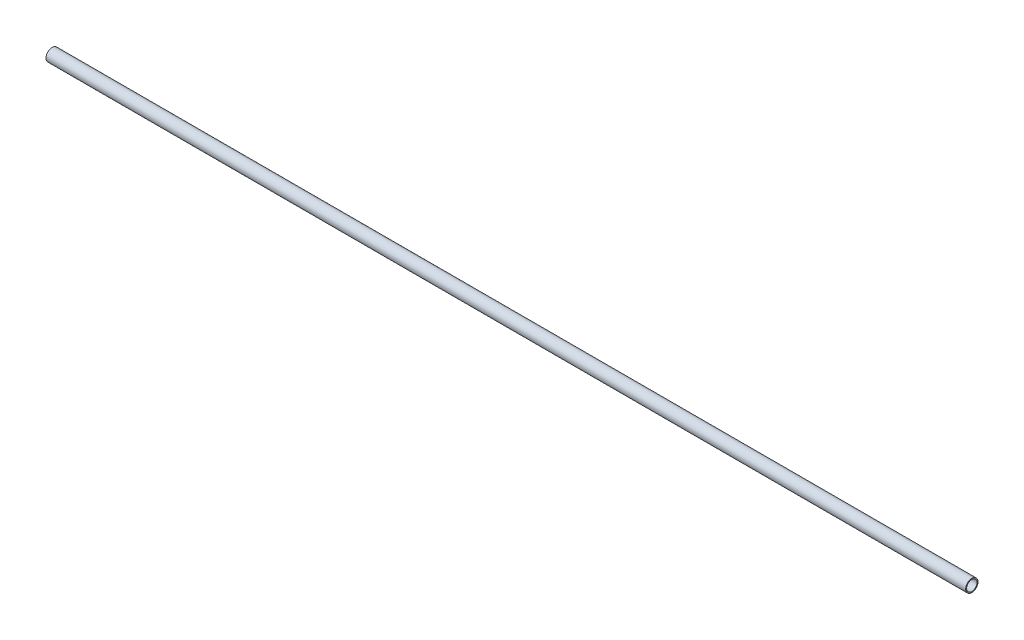
ISO-10303-21;
HEADER;
FILE_DESCRIPTION(('STEP AP214'),'2;1');
FILE_NAME('part.step','',(''),(''),'','','');
FILE_SCHEMA(('AUTOMOTIVE_DESIGN { 1 0 10303 214 1 1 1 1 }'));
ENDSEC;
DATA;
#1=APPLICATION_CONTEXT('core data for automotive mechanical design processes');
#2=APPLICATION_PROTOCOL_DEFINITION('international standard','automotive_design',2000,#1);
#3=PRODUCT_CONTEXT('',#1,'mechanical');
#4=PRODUCT('Part','Part','',(#3));
#5=PRODUCT_RELATED_PRODUCT_CATEGORY('part','',(#4));
#6=PRODUCT_DEFINITION_FORMATION('','',#4);
#7=PRODUCT_DEFINITION_CONTEXT('part definition',#1,'design');
#8=PRODUCT_DEFINITION('design','',#6,#7);
#9=PRODUCT_DEFINITION_SHAPE('','',#8);
#10=(LENGTH_UNIT() NAMED_UNIT(*) SI_UNIT(.MILLI.,.METRE.));
#11=(NAMED_UNIT(*) PLANE_ANGLE_UNIT() SI_UNIT($,.RADIAN.));
#12=(NAMED_UNIT(*) SI_UNIT($,.STERADIAN.) SOLID_ANGLE_UNIT());
#13=UNCERTAINTY_MEASURE_WITH_UNIT(LENGTH_MEASURE(1.E-05),#10,'distance_accuracy_value','');
#14=(GEOMETRIC_REPRESENTATION_CONTEXT(3) GLOBAL_UNCERTAINTY_ASSIGNED_CONTEXT((#13)) GLOBAL_UNIT_ASSIGNED_CONTEXT((#10,
#11,#12)) REPRESENTATION_CONTEXT('',''));
#15=CARTESIAN_POINT('',(0.,0.,0.));
#16=DIRECTION('',(0.,0.,1.));
#17=DIRECTION('',(1.,0.,0.));
#18=AXIS2_PLACEMENT_3D('',#15,#16,#17);
#19=CARTESIAN_POINT('',(-472.313,0.,0.));
#20=DIRECTION('',(1.,0.,0.));
#21=DIRECTION('',(0.,0.,1.));
#22=AXIS2_PLACEMENT_3D('',#19,#20,#21);
#23=CYLINDRICAL_SURFACE('',#22,3.175);
#24=CARTESIAN_POINT('',(-472.313,0.,0.));
#25=DIRECTION('',(-1.,0.,0.));
#26=DIRECTION('',(0.,0.,1.));
#27=AXIS2_PLACEMENT_3D('',#24,#25,#26);
#28=CIRCLE('',#27,3.175);
#29=CARTESIAN_POINT('',(-472.313,0.,3.175));
#30=VERTEX_POINT('',#29);
#31=EDGE_CURVE('E10',#30,#30,#28,.T.);
#32=ORIENTED_EDGE('',*,*,#31,.F.);
#33=EDGE_LOOP('',(#32));
#34=FACE_BOUND('',#33,.T.);
#35=CARTESIAN_POINT('',(0.,0.,0.));
#36=DIRECTION('',(-1.,0.,0.));
#37=DIRECTION('',(0.,0.,1.));
#38=AXIS2_PLACEMENT_3D('',#35,#36,#37);
#39=CIRCLE('',#38,3.175);
#40=CARTESIAN_POINT('',(0.,0.,3.175));
#41=VERTEX_POINT('',#40);
#42=EDGE_CURVE('E42',#41,#41,#39,.T.);
#43=ORIENTED_EDGE('',*,*,#42,.T.);
#44=EDGE_LOOP('',(#43));
#45=FACE_BOUND('',#44,.T.);
#46=ADVANCED_FACE('F39',(#34,#45),#23,.T.);
#47=CARTESIAN_POINT('',(-472.313,0.,0.));
#48=DIRECTION('',(1.,0.,0.));
#49=DIRECTION('',(0.,0.,1.));
#50=AXIS2_PLACEMENT_3D('',#47,#48,#49);
#51=PLANE('',#50);
#52=CARTESIAN_POINT('',(-472.313,0.,0.));
#53=DIRECTION('',(-1.,0.,0.));
#54=DIRECTION('',(0.,0.,1.));
#55=AXIS2_PLACEMENT_3D('',#52,#53,#54);
#56=CIRCLE('',#55,2.667);
#57=CARTESIAN_POINT('',(-472.313,0.,2.667));
#58=VERTEX_POINT('',#57);
#59=EDGE_CURVE('E49',#58,#58,#56,.T.);
#60=ORIENTED_EDGE('',*,*,#59,.F.);
#61=EDGE_LOOP('',(#60));
#62=FACE_BOUND('',#61,.T.);
#63=ORIENTED_EDGE('',*,*,#31,.T.);
#64=EDGE_LOOP('',(#63));
#65=FACE_BOUND('',#64,.T.);
#66=ADVANCED_FACE('F60',(#62,#65),#51,.F.);
#67=CARTESIAN_POINT('',(0.,0.,0.));
#68=DIRECTION('',(1.,0.,0.));
#69=DIRECTION('',(0.,0.,1.));
#70=AXIS2_PLACEMENT_3D('',#67,#68,#69);
#71=PLANE('',#70);
#72=CARTESIAN_POINT('',(0.,0.,0.));
#73=DIRECTION('',(-1.,0.,0.));
#74=DIRECTION('',(0.,0.,1.));
#75=AXIS2_PLACEMENT_3D('',#72,#73,#74);
#76=CIRCLE('',#75,2.667);
#77=CARTESIAN_POINT('',(0.,0.,2.667));
#78=VERTEX_POINT('',#77);
#79=EDGE_CURVE('E51',#78,#78,#76,.T.);
#80=ORIENTED_EDGE('',*,*,#79,.T.);
#81=EDGE_LOOP('',(#80));
#82=FACE_BOUND('',#81,.T.);
#83=ORIENTED_EDGE('',*,*,#42,.F.);
#84=EDGE_LOOP('',(#83));
#85=FACE_BOUND('',#84,.T.);
#86=ADVANCED_FACE('F62',(#82,#85),#71,.T.);
#87=CARTESIAN_POINT('',(-472.313,0.,0.));
#88=DIRECTION('',(1.,0.,0.));
#89=DIRECTION('',(0.,0.,1.));
#90=AXIS2_PLACEMENT_3D('',#87,#88,#89);
#91=CYLINDRICAL_SURFACE('',#90,2.667);
#92=ORIENTED_EDGE('',*,*,#59,.T.);
#93=EDGE_LOOP('',(#92));
#94=FACE_BOUND('',#93,.T.);
#95=ORIENTED_EDGE('',*,*,#79,.F.);
#96=EDGE_LOOP('',(#95));
#97=FACE_BOUND('',#96,.T.);
#98=ADVANCED_FACE('F57',(#94,#97),#91,.F.);
#99=CLOSED_SHELL('',(#46,#66,#86,#98));
#100=MANIFOLD_SOLID_BREP('B2',#99);
#101=ADVANCED_BREP_SHAPE_REPRESENTATION('',(#18,#100),#14);
#102=SHAPE_DEFINITION_REPRESENTATION(#9,#101);
ENDSEC;
END-ISO-10303-21;
